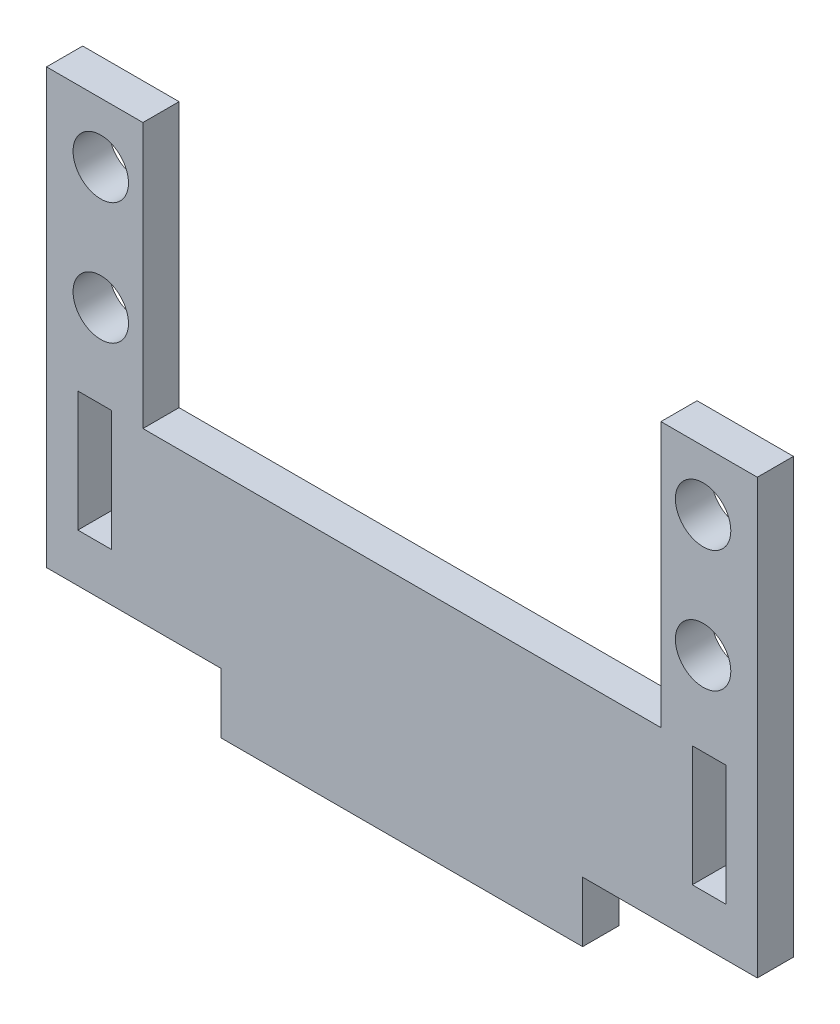
ISO-10303-21;
HEADER;
FILE_DESCRIPTION(('STEP AP214'),'2;1');
FILE_NAME('part.step','',(''),(''),'','','');
FILE_SCHEMA(('AUTOMOTIVE_DESIGN { 1 0 10303 214 1 1 1 1 }'));
ENDSEC;
DATA;
#1=APPLICATION_CONTEXT('core data for automotive mechanical design processes');
#2=APPLICATION_PROTOCOL_DEFINITION('international standard','automotive_design',2000,#1);
#3=PRODUCT_CONTEXT('',#1,'mechanical');
#4=PRODUCT('Part','Part','',(#3));
#5=PRODUCT_RELATED_PRODUCT_CATEGORY('part','',(#4));
#6=PRODUCT_DEFINITION_FORMATION('','',#4);
#7=PRODUCT_DEFINITION_CONTEXT('part definition',#1,'design');
#8=PRODUCT_DEFINITION('design','',#6,#7);
#9=PRODUCT_DEFINITION_SHAPE('','',#8);
#10=(LENGTH_UNIT() NAMED_UNIT(*) SI_UNIT(.MILLI.,.METRE.));
#11=(NAMED_UNIT(*) PLANE_ANGLE_UNIT() SI_UNIT($,.RADIAN.));
#12=(NAMED_UNIT(*) SI_UNIT($,.STERADIAN.) SOLID_ANGLE_UNIT());
#13=UNCERTAINTY_MEASURE_WITH_UNIT(LENGTH_MEASURE(1.E-05),#10,'distance_accuracy_value','');
#14=(GEOMETRIC_REPRESENTATION_CONTEXT(3) GLOBAL_UNCERTAINTY_ASSIGNED_CONTEXT((#13)) GLOBAL_UNIT_ASSIGNED_CONTEXT((#10,
#11,#12)) REPRESENTATION_CONTEXT('',''));
#15=CARTESIAN_POINT('',(0.,0.,0.));
#16=DIRECTION('',(0.,0.,1.));
#17=DIRECTION('',(1.,0.,0.));
#18=AXIS2_PLACEMENT_3D('',#15,#16,#17);
#19=CARTESIAN_POINT('',(0.,-36.,3.));
#20=DIRECTION('',(0.,1.,0.));
#21=DIRECTION('',(0.,0.,1.));
#22=AXIS2_PLACEMENT_3D('',#19,#20,#21);
#23=PLANE('',#22);
#24=DIRECTION('',(0.,0.,-1.));
#25=VECTOR('',#24,1.);
#26=CARTESIAN_POINT('',(14.5,-36.,3.));
#27=LINE('',#26,#25);
#28=CARTESIAN_POINT('',(14.5,-36.,3.));
#29=VERTEX_POINT('',#28);
#30=CARTESIAN_POINT('',(14.5,-36.,0.));
#31=VERTEX_POINT('',#30);
#32=EDGE_CURVE('E51',#29,#31,#27,.T.);
#33=ORIENTED_EDGE('',*,*,#32,.F.);
#34=DIRECTION('',(1.,0.,0.));
#35=VECTOR('',#34,1.);
#36=CARTESIAN_POINT('',(0.,-36.,3.));
#37=LINE('',#36,#35);
#38=CARTESIAN_POINT('',(0.,-36.,3.));
#39=VERTEX_POINT('',#38);
#40=EDGE_CURVE('E230',#39,#29,#37,.T.);
#41=ORIENTED_EDGE('',*,*,#40,.F.);
#42=DIRECTION('',(0.,0.,-1.));
#43=VECTOR('',#42,1.);
#44=CARTESIAN_POINT('',(0.,-36.,3.));
#45=LINE('',#44,#43);
#46=CARTESIAN_POINT('',(0.,-36.,0.));
#47=VERTEX_POINT('',#46);
#48=EDGE_CURVE('E315',#39,#47,#45,.T.);
#49=ORIENTED_EDGE('',*,*,#48,.T.);
#50=DIRECTION('',(1.,0.,0.));
#51=VECTOR('',#50,1.);
#52=CARTESIAN_POINT('',(0.,-36.,0.));
#53=LINE('',#52,#51);
#54=EDGE_CURVE('E283',#47,#31,#53,.T.);
#55=ORIENTED_EDGE('',*,*,#54,.T.);
#56=EDGE_LOOP('',(#33,#41,#49,#55));
#57=FACE_BOUND('',#56,.T.);
#58=ADVANCED_FACE('F34',(#57),#23,.F.);
#59=DIRECTION('',(0.,0.,1.));
#60=VECTOR('',#59,1.);
#61=CARTESIAN_POINT('',(44.5,-36.,3.));
#62=LINE('',#61,#60);
#63=CARTESIAN_POINT('',(44.5,-36.,0.));
#64=VERTEX_POINT('',#63);
#65=CARTESIAN_POINT('',(44.5,-36.,3.));
#66=VERTEX_POINT('',#65);
#67=EDGE_CURVE('E59',#64,#66,#62,.T.);
#68=ORIENTED_EDGE('',*,*,#67,.F.);
#69=CARTESIAN_POINT('',(59.,-36.,0.));
#70=VERTEX_POINT('',#69);
#71=EDGE_CURVE('E241',#64,#70,#53,.T.);
#72=ORIENTED_EDGE('',*,*,#71,.T.);
#73=DIRECTION('',(0.,0.,-1.));
#74=VECTOR('',#73,1.);
#75=CARTESIAN_POINT('',(59.,-36.,3.));
#76=LINE('',#75,#74);
#77=CARTESIAN_POINT('',(59.,-36.,3.));
#78=VERTEX_POINT('',#77);
#79=EDGE_CURVE('E317',#78,#70,#76,.T.);
#80=ORIENTED_EDGE('',*,*,#79,.F.);
#81=EDGE_CURVE('E217',#66,#78,#37,.T.);
#82=ORIENTED_EDGE('',*,*,#81,.F.);
#83=EDGE_LOOP('',(#68,#72,#80,#82));
#84=FACE_BOUND('',#83,.T.);
#85=ADVANCED_FACE('F374',(#84),#23,.F.);
#86=CARTESIAN_POINT('',(0.,0.,3.));
#87=DIRECTION('',(0.,1.,0.));
#88=DIRECTION('',(-1.,0.,0.));
#89=AXIS2_PLACEMENT_3D('',#86,#87,#88);
#90=PLANE('',#89);
#91=DIRECTION('',(1.,0.,0.));
#92=VECTOR('',#91,1.);
#93=CARTESIAN_POINT('',(0.,0.,0.));
#94=LINE('',#93,#92);
#95=CARTESIAN_POINT('',(51.,0.,0.));
#96=VERTEX_POINT('',#95);
#97=CARTESIAN_POINT('',(59.,0.,0.));
#98=VERTEX_POINT('',#97);
#99=EDGE_CURVE('E262',#96,#98,#94,.T.);
#100=ORIENTED_EDGE('',*,*,#99,.F.);
#101=DIRECTION('',(0.,0.,-1.));
#102=VECTOR('',#101,1.);
#103=CARTESIAN_POINT('',(51.,0.,3.));
#104=LINE('',#103,#102);
#105=CARTESIAN_POINT('',(51.,0.,3.));
#106=VERTEX_POINT('',#105);
#107=EDGE_CURVE('E305',#106,#96,#104,.T.);
#108=ORIENTED_EDGE('',*,*,#107,.F.);
#109=DIRECTION('',(1.,0.,0.));
#110=VECTOR('',#109,1.);
#111=CARTESIAN_POINT('',(0.,0.,3.));
#112=LINE('',#111,#110);
#113=CARTESIAN_POINT('',(59.,0.,3.));
#114=VERTEX_POINT('',#113);
#115=EDGE_CURVE('E323',#106,#114,#112,.T.);
#116=ORIENTED_EDGE('',*,*,#115,.T.);
#117=DIRECTION('',(0.,0.,-1.));
#118=VECTOR('',#117,1.);
#119=CARTESIAN_POINT('',(59.,0.,3.));
#120=LINE('',#119,#118);
#121=EDGE_CURVE('E238',#114,#98,#120,.T.);
#122=ORIENTED_EDGE('',*,*,#121,.T.);
#123=EDGE_LOOP('',(#100,#108,#116,#122));
#124=FACE_BOUND('',#123,.T.);
#125=ADVANCED_FACE('F322',(#124),#90,.T.);
#126=CARTESIAN_POINT('',(51.,0.,3.));
#127=DIRECTION('',(-1.,0.,0.));
#128=DIRECTION('',(0.,0.,1.));
#129=AXIS2_PLACEMENT_3D('',#126,#127,#128);
#130=PLANE('',#129);
#131=DIRECTION('',(0.,1.,0.));
#132=VECTOR('',#131,1.);
#133=CARTESIAN_POINT('',(51.,0.,0.));
#134=LINE('',#133,#132);
#135=CARTESIAN_POINT('',(51.,-22.,0.));
#136=VERTEX_POINT('',#135);
#137=EDGE_CURVE('E264',#136,#96,#134,.T.);
#138=ORIENTED_EDGE('',*,*,#137,.F.);
#139=DIRECTION('',(0.,0.,-1.));
#140=VECTOR('',#139,1.);
#141=CARTESIAN_POINT('',(51.,-22.,3.));
#142=LINE('',#141,#140);
#143=CARTESIAN_POINT('',(51.,-22.,3.));
#144=VERTEX_POINT('',#143);
#145=EDGE_CURVE('E307',#144,#136,#142,.T.);
#146=ORIENTED_EDGE('',*,*,#145,.F.);
#147=DIRECTION('',(0.,1.,0.));
#148=VECTOR('',#147,1.);
#149=CARTESIAN_POINT('',(51.,0.,3.));
#150=LINE('',#149,#148);
#151=EDGE_CURVE('E350',#144,#106,#150,.T.);
#152=ORIENTED_EDGE('',*,*,#151,.T.);
#153=ORIENTED_EDGE('',*,*,#107,.T.);
#154=EDGE_LOOP('',(#138,#146,#152,#153));
#155=FACE_BOUND('',#154,.T.);
#156=ADVANCED_FACE('F392',(#155),#130,.T.);
#157=CARTESIAN_POINT('',(0.,-22.,3.));
#158=DIRECTION('',(0.,1.,0.));
#159=DIRECTION('',(0.,0.,1.));
#160=AXIS2_PLACEMENT_3D('',#157,#158,#159);
#161=PLANE('',#160);
#162=DIRECTION('',(1.,0.,0.));
#163=VECTOR('',#162,1.);
#164=CARTESIAN_POINT('',(0.,-22.,0.));
#165=LINE('',#164,#163);
#166=CARTESIAN_POINT('',(8.,-22.,0.));
#167=VERTEX_POINT('',#166);
#168=EDGE_CURVE('E267',#167,#136,#165,.T.);
#169=ORIENTED_EDGE('',*,*,#168,.F.);
#170=DIRECTION('',(0.,0.,-1.));
#171=VECTOR('',#170,1.);
#172=CARTESIAN_POINT('',(8.,-22.,3.));
#173=LINE('',#172,#171);
#174=CARTESIAN_POINT('',(8.,-22.,3.));
#175=VERTEX_POINT('',#174);
#176=EDGE_CURVE('E309',#175,#167,#173,.T.);
#177=ORIENTED_EDGE('',*,*,#176,.F.);
#178=DIRECTION('',(1.,0.,0.));
#179=VECTOR('',#178,1.);
#180=CARTESIAN_POINT('',(0.,-22.,3.));
#181=LINE('',#180,#179);
#182=EDGE_CURVE('E353',#175,#144,#181,.T.);
#183=ORIENTED_EDGE('',*,*,#182,.T.);
#184=ORIENTED_EDGE('',*,*,#145,.T.);
#185=EDGE_LOOP('',(#169,#177,#183,#184));
#186=FACE_BOUND('',#185,.T.);
#187=ADVANCED_FACE('F389',(#186),#161,.T.);
#188=CARTESIAN_POINT('',(8.,0.,3.));
#189=DIRECTION('',(1.,0.,0.));
#190=DIRECTION('',(0.,0.,-1.));
#191=AXIS2_PLACEMENT_3D('',#188,#189,#190);
#192=PLANE('',#191);
#193=DIRECTION('',(0.,-1.,0.));
#194=VECTOR('',#193,1.);
#195=CARTESIAN_POINT('',(8.,0.,0.));
#196=LINE('',#195,#194);
#197=CARTESIAN_POINT('',(8.,0.,0.));
#198=VERTEX_POINT('',#197);
#199=EDGE_CURVE('E270',#198,#167,#196,.T.);
#200=ORIENTED_EDGE('',*,*,#199,.F.);
#201=DIRECTION('',(0.,0.,-1.));
#202=VECTOR('',#201,1.);
#203=CARTESIAN_POINT('',(8.,0.,3.));
#204=LINE('',#203,#202);
#205=CARTESIAN_POINT('',(8.,0.,3.));
#206=VERTEX_POINT('',#205);
#207=EDGE_CURVE('E311',#206,#198,#204,.T.);
#208=ORIENTED_EDGE('',*,*,#207,.F.);
#209=DIRECTION('',(0.,-1.,0.));
#210=VECTOR('',#209,1.);
#211=CARTESIAN_POINT('',(8.,0.,3.));
#212=LINE('',#211,#210);
#213=EDGE_CURVE('E356',#206,#175,#212,.T.);
#214=ORIENTED_EDGE('',*,*,#213,.T.);
#215=ORIENTED_EDGE('',*,*,#176,.T.);
#216=EDGE_LOOP('',(#200,#208,#214,#215));
#217=FACE_BOUND('',#216,.T.);
#218=ADVANCED_FACE('F368',(#217),#192,.T.);
#219=CARTESIAN_POINT('',(0.,0.,3.));
#220=DIRECTION('',(0.,1.,0.));
#221=DIRECTION('',(0.,0.,1.));
#222=AXIS2_PLACEMENT_3D('',#219,#220,#221);
#223=PLANE('',#222);
#224=DIRECTION('',(1.,0.,0.));
#225=VECTOR('',#224,1.);
#226=CARTESIAN_POINT('',(0.,0.,0.));
#227=LINE('',#226,#225);
#228=CARTESIAN_POINT('',(0.,0.,0.));
#229=VERTEX_POINT('',#228);
#230=EDGE_CURVE('E273',#229,#198,#227,.T.);
#231=ORIENTED_EDGE('',*,*,#230,.F.);
#232=DIRECTION('',(0.,0.,-1.));
#233=VECTOR('',#232,1.);
#234=CARTESIAN_POINT('',(0.,0.,3.));
#235=LINE('',#234,#233);
#236=CARTESIAN_POINT('',(0.,0.,3.));
#237=VERTEX_POINT('',#236);
#238=EDGE_CURVE('E313',#237,#229,#235,.T.);
#239=ORIENTED_EDGE('',*,*,#238,.F.);
#240=DIRECTION('',(1.,0.,0.));
#241=VECTOR('',#240,1.);
#242=CARTESIAN_POINT('',(0.,0.,3.));
#243=LINE('',#242,#241);
#244=EDGE_CURVE('E358',#237,#206,#243,.T.);
#245=ORIENTED_EDGE('',*,*,#244,.T.);
#246=ORIENTED_EDGE('',*,*,#207,.T.);
#247=EDGE_LOOP('',(#231,#239,#245,#246));
#248=FACE_BOUND('',#247,.T.);
#249=ADVANCED_FACE('F362',(#248),#223,.T.);
#250=CARTESIAN_POINT('',(0.,0.,3.));
#251=DIRECTION('',(1.,0.,0.));
#252=DIRECTION('',(0.,1.,0.));
#253=AXIS2_PLACEMENT_3D('',#250,#251,#252);
#254=PLANE('',#253);
#255=DIRECTION('',(0.,-1.,0.));
#256=VECTOR('',#255,1.);
#257=CARTESIAN_POINT('',(0.,0.,0.));
#258=LINE('',#257,#256);
#259=EDGE_CURVE('E276',#229,#47,#258,.T.);
#260=ORIENTED_EDGE('',*,*,#259,.T.);
#261=ORIENTED_EDGE('',*,*,#48,.F.);
#262=DIRECTION('',(0.,-1.,0.));
#263=VECTOR('',#262,1.);
#264=CARTESIAN_POINT('',(0.,0.,3.));
#265=LINE('',#264,#263);
#266=EDGE_CURVE('E233',#237,#39,#265,.T.);
#267=ORIENTED_EDGE('',*,*,#266,.F.);
#268=ORIENTED_EDGE('',*,*,#238,.T.);
#269=EDGE_LOOP('',(#260,#261,#267,#268));
#270=FACE_BOUND('',#269,.T.);
#271=ADVANCED_FACE('F372',(#270),#254,.F.);
#272=CARTESIAN_POINT('',(4.5,-15.05,3.));
#273=DIRECTION('',(0.,0.,-1.));
#274=DIRECTION('',(-1.,0.,0.));
#275=AXIS2_PLACEMENT_3D('',#272,#273,#274);
#276=CYLINDRICAL_SURFACE('',#275,2.3);
#277=CARTESIAN_POINT('',(4.5,-15.05,3.));
#278=DIRECTION('',(0.,0.,1.));
#279=DIRECTION('',(1.,0.,0.));
#280=AXIS2_PLACEMENT_3D('',#277,#278,#279);
#281=CIRCLE('',#280,2.3);
#282=CARTESIAN_POINT('',(6.8,-15.05,3.));
#283=VERTEX_POINT('',#282);
#284=EDGE_CURVE('E346',#283,#283,#281,.T.);
#285=ORIENTED_EDGE('',*,*,#284,.T.);
#286=EDGE_LOOP('',(#285));
#287=FACE_BOUND('',#286,.T.);
#288=CARTESIAN_POINT('',(4.5,-15.05,0.));
#289=DIRECTION('',(0.,0.,1.));
#290=DIRECTION('',(1.,0.,0.));
#291=AXIS2_PLACEMENT_3D('',#288,#289,#290);
#292=CIRCLE('',#291,2.3);
#293=CARTESIAN_POINT('',(6.8,-15.05,0.));
#294=VERTEX_POINT('',#293);
#295=EDGE_CURVE('E259',#294,#294,#292,.T.);
#296=ORIENTED_EDGE('',*,*,#295,.F.);
#297=EDGE_LOOP('',(#296));
#298=FACE_BOUND('',#297,.T.);
#299=ADVANCED_FACE('F384',(#287,#298),#276,.F.);
#300=CARTESIAN_POINT('',(4.5,-4.95,3.));
#301=DIRECTION('',(0.,0.,-1.));
#302=DIRECTION('',(-1.,0.,0.));
#303=AXIS2_PLACEMENT_3D('',#300,#301,#302);
#304=CYLINDRICAL_SURFACE('',#303,2.3);
#305=CARTESIAN_POINT('',(4.5,-4.95,3.));
#306=DIRECTION('',(0.,0.,1.));
#307=DIRECTION('',(1.,0.,0.));
#308=AXIS2_PLACEMENT_3D('',#305,#306,#307);
#309=CIRCLE('',#308,2.3);
#310=CARTESIAN_POINT('',(6.8,-4.95,3.));
#311=VERTEX_POINT('',#310);
#312=EDGE_CURVE('E338',#311,#311,#309,.T.);
#313=ORIENTED_EDGE('',*,*,#312,.T.);
#314=EDGE_LOOP('',(#313));
#315=FACE_BOUND('',#314,.T.);
#316=CARTESIAN_POINT('',(4.5,-4.95,0.));
#317=DIRECTION('',(0.,0.,1.));
#318=DIRECTION('',(1.,0.,0.));
#319=AXIS2_PLACEMENT_3D('',#316,#317,#318);
#320=CIRCLE('',#319,2.3);
#321=CARTESIAN_POINT('',(6.8,-4.95,0.));
#322=VERTEX_POINT('',#321);
#323=EDGE_CURVE('E256',#322,#322,#320,.T.);
#324=ORIENTED_EDGE('',*,*,#323,.F.);
#325=EDGE_LOOP('',(#324));
#326=FACE_BOUND('',#325,.T.);
#327=ADVANCED_FACE('F401',(#315,#326),#304,.F.);
#328=CARTESIAN_POINT('',(54.5,-4.94999999999999,3.));
#329=DIRECTION('',(0.,0.,-1.));
#330=DIRECTION('',(-1.,0.,0.));
#331=AXIS2_PLACEMENT_3D('',#328,#329,#330);
#332=CYLINDRICAL_SURFACE('',#331,2.3);
#333=CARTESIAN_POINT('',(54.5,-4.94999999999999,3.));
#334=DIRECTION('',(0.,0.,1.));
#335=DIRECTION('',(1.,0.,0.));
#336=AXIS2_PLACEMENT_3D('',#333,#334,#335);
#337=CIRCLE('',#336,2.3);
#338=CARTESIAN_POINT('',(56.8,-4.94999999999999,3.));
#339=VERTEX_POINT('',#338);
#340=EDGE_CURVE('E333',#339,#339,#337,.T.);
#341=ORIENTED_EDGE('',*,*,#340,.T.);
#342=EDGE_LOOP('',(#341));
#343=FACE_BOUND('',#342,.T.);
#344=CARTESIAN_POINT('',(54.5,-4.94999999999999,0.));
#345=DIRECTION('',(0.,0.,1.));
#346=DIRECTION('',(1.,0.,0.));
#347=AXIS2_PLACEMENT_3D('',#344,#345,#346);
#348=CIRCLE('',#347,2.3);
#349=CARTESIAN_POINT('',(56.8,-4.94999999999999,0.));
#350=VERTEX_POINT('',#349);
#351=EDGE_CURVE('E252',#350,#350,#348,.T.);
#352=ORIENTED_EDGE('',*,*,#351,.F.);
#353=EDGE_LOOP('',(#352));
#354=FACE_BOUND('',#353,.T.);
#355=ADVANCED_FACE('F404',(#343,#354),#332,.F.);
#356=CARTESIAN_POINT('',(54.5,-15.05,3.));
#357=DIRECTION('',(0.,0.,-1.));
#358=DIRECTION('',(-1.,0.,0.));
#359=AXIS2_PLACEMENT_3D('',#356,#357,#358);
#360=CYLINDRICAL_SURFACE('',#359,2.3);
#361=CARTESIAN_POINT('',(54.5,-15.05,3.));
#362=DIRECTION('',(0.,0.,1.));
#363=DIRECTION('',(1.,0.,0.));
#364=AXIS2_PLACEMENT_3D('',#361,#362,#363);
#365=CIRCLE('',#364,2.3);
#366=CARTESIAN_POINT('',(56.8,-15.05,3.));
#367=VERTEX_POINT('',#366);
#368=EDGE_CURVE('E331',#367,#367,#365,.T.);
#369=ORIENTED_EDGE('',*,*,#368,.T.);
#370=EDGE_LOOP('',(#369));
#371=FACE_BOUND('',#370,.T.);
#372=CARTESIAN_POINT('',(54.5,-15.05,0.));
#373=DIRECTION('',(0.,0.,1.));
#374=DIRECTION('',(1.,0.,0.));
#375=AXIS2_PLACEMENT_3D('',#372,#373,#374);
#376=CIRCLE('',#375,2.3);
#377=CARTESIAN_POINT('',(56.8,-15.05,0.));
#378=VERTEX_POINT('',#377);
#379=EDGE_CURVE('E249',#378,#378,#376,.T.);
#380=ORIENTED_EDGE('',*,*,#379,.F.);
#381=EDGE_LOOP('',(#380));
#382=FACE_BOUND('',#381,.T.);
#383=ADVANCED_FACE('F36',(#371,#382),#360,.F.);
#384=CARTESIAN_POINT('',(59.,0.,3.));
#385=DIRECTION('',(1.,0.,0.));
#386=DIRECTION('',(0.,1.,0.));
#387=AXIS2_PLACEMENT_3D('',#384,#385,#386);
#388=PLANE('',#387);
#389=DIRECTION('',(0.,-1.,0.));
#390=VECTOR('',#389,1.);
#391=CARTESIAN_POINT('',(59.,0.,0.));
#392=LINE('',#391,#390);
#393=EDGE_CURVE('E280',#98,#70,#392,.T.);
#394=ORIENTED_EDGE('',*,*,#393,.F.);
#395=ORIENTED_EDGE('',*,*,#121,.F.);
#396=DIRECTION('',(0.,-1.,0.));
#397=VECTOR('',#396,1.);
#398=CARTESIAN_POINT('',(59.,0.,3.));
#399=LINE('',#398,#397);
#400=EDGE_CURVE('E236',#114,#78,#399,.T.);
#401=ORIENTED_EDGE('',*,*,#400,.T.);
#402=ORIENTED_EDGE('',*,*,#79,.T.);
#403=EDGE_LOOP('',(#394,#395,#401,#402));
#404=FACE_BOUND('',#403,.T.);
#405=ADVANCED_FACE('F329',(#404),#388,.T.);
#406=CARTESIAN_POINT('',(0.,0.,3.));
#407=DIRECTION('',(0.,0.,1.));
#408=DIRECTION('',(1.,0.,0.));
#409=AXIS2_PLACEMENT_3D('',#406,#407,#408);
#410=PLANE('',#409);
#411=DIRECTION('',(0.,-1.,0.));
#412=VECTOR('',#411,1.);
#413=CARTESIAN_POINT('',(53.6,-22.,3.));
#414=LINE('',#413,#412);
#415=CARTESIAN_POINT('',(53.6,-22.,3.));
#416=VERTEX_POINT('',#415);
#417=CARTESIAN_POINT('',(53.6,-32.,3.));
#418=VERTEX_POINT('',#417);
#419=EDGE_CURVE('E195',#416,#418,#414,.T.);
#420=ORIENTED_EDGE('',*,*,#419,.F.);
#421=DIRECTION('',(-1.,0.,0.));
#422=VECTOR('',#421,1.);
#423=CARTESIAN_POINT('',(53.6,-22.,3.));
#424=LINE('',#423,#422);
#425=CARTESIAN_POINT('',(56.4,-22.,3.));
#426=VERTEX_POINT('',#425);
#427=EDGE_CURVE('E630',#426,#416,#424,.T.);
#428=ORIENTED_EDGE('',*,*,#427,.F.);
#429=DIRECTION('',(0.,1.,0.));
#430=VECTOR('',#429,1.);
#431=CARTESIAN_POINT('',(56.4,-22.,3.));
#432=LINE('',#431,#430);
#433=CARTESIAN_POINT('',(56.4,-32.,3.));
#434=VERTEX_POINT('',#433);
#435=EDGE_CURVE('E637',#434,#426,#432,.T.);
#436=ORIENTED_EDGE('',*,*,#435,.F.);
#437=DIRECTION('',(1.,0.,0.));
#438=VECTOR('',#437,1.);
#439=CARTESIAN_POINT('',(53.6,-32.,3.));
#440=LINE('',#439,#438);
#441=EDGE_CURVE('E197',#418,#434,#440,.T.);
#442=ORIENTED_EDGE('',*,*,#441,.F.);
#443=EDGE_LOOP('',(#420,#428,#436,#442));
#444=FACE_BOUND('',#443,.T.);
#445=DIRECTION('',(0.,-1.,0.));
#446=VECTOR('',#445,1.);
#447=CARTESIAN_POINT('',(2.6,-22.,3.));
#448=LINE('',#447,#446);
#449=CARTESIAN_POINT('',(2.6,-22.,3.));
#450=VERTEX_POINT('',#449);
#451=CARTESIAN_POINT('',(2.6,-32.,3.));
#452=VERTEX_POINT('',#451);
#453=EDGE_CURVE('E647',#450,#452,#448,.T.);
#454=ORIENTED_EDGE('',*,*,#453,.F.);
#455=DIRECTION('',(-1.,0.,0.));
#456=VECTOR('',#455,1.);
#457=CARTESIAN_POINT('',(2.6,-22.,3.));
#458=LINE('',#457,#456);
#459=CARTESIAN_POINT('',(5.4,-22.,3.));
#460=VERTEX_POINT('',#459);
#461=EDGE_CURVE('E657',#460,#450,#458,.T.);
#462=ORIENTED_EDGE('',*,*,#461,.F.);
#463=DIRECTION('',(0.,1.,0.));
#464=VECTOR('',#463,1.);
#465=CARTESIAN_POINT('',(5.4,-22.,3.));
#466=LINE('',#465,#464);
#467=CARTESIAN_POINT('',(5.4,-32.,3.));
#468=VERTEX_POINT('',#467);
#469=EDGE_CURVE('E654',#468,#460,#466,.T.);
#470=ORIENTED_EDGE('',*,*,#469,.F.);
#471=DIRECTION('',(1.,0.,0.));
#472=VECTOR('',#471,1.);
#473=CARTESIAN_POINT('',(2.6,-32.,3.));
#474=LINE('',#473,#472);
#475=EDGE_CURVE('E651',#452,#468,#474,.T.);
#476=ORIENTED_EDGE('',*,*,#475,.F.);
#477=EDGE_LOOP('',(#454,#462,#470,#476));
#478=FACE_BOUND('',#477,.T.);
#479=ORIENTED_EDGE('',*,*,#368,.F.);
#480=EDGE_LOOP('',(#479));
#481=FACE_BOUND('',#480,.T.);
#482=ORIENTED_EDGE('',*,*,#340,.F.);
#483=EDGE_LOOP('',(#482));
#484=FACE_BOUND('',#483,.T.);
#485=ORIENTED_EDGE('',*,*,#312,.F.);
#486=EDGE_LOOP('',(#485));
#487=FACE_BOUND('',#486,.T.);
#488=ORIENTED_EDGE('',*,*,#284,.F.);
#489=EDGE_LOOP('',(#488));
#490=FACE_BOUND('',#489,.T.);
#491=ORIENTED_EDGE('',*,*,#115,.F.);
#492=ORIENTED_EDGE('',*,*,#151,.F.);
#493=ORIENTED_EDGE('',*,*,#182,.F.);
#494=ORIENTED_EDGE('',*,*,#213,.F.);
#495=ORIENTED_EDGE('',*,*,#244,.F.);
#496=ORIENTED_EDGE('',*,*,#266,.T.);
#497=ORIENTED_EDGE('',*,*,#40,.T.);
#498=DIRECTION('',(0.,1.,0.));
#499=VECTOR('',#498,1.);
#500=CARTESIAN_POINT('',(14.5,-41.,3.));
#501=LINE('',#500,#499);
#502=CARTESIAN_POINT('',(14.5,-41.,3.));
#503=VERTEX_POINT('',#502);
#504=EDGE_CURVE('E207',#503,#29,#501,.T.);
#505=ORIENTED_EDGE('',*,*,#504,.F.);
#506=DIRECTION('',(-1.,0.,0.));
#507=VECTOR('',#506,1.);
#508=CARTESIAN_POINT('',(14.5,-41.,3.));
#509=LINE('',#508,#507);
#510=CARTESIAN_POINT('',(44.5,-41.,3.));
#511=VERTEX_POINT('',#510);
#512=EDGE_CURVE('E189',#511,#503,#509,.T.);
#513=ORIENTED_EDGE('',*,*,#512,.F.);
#514=DIRECTION('',(0.,1.,0.));
#515=VECTOR('',#514,1.);
#516=CARTESIAN_POINT('',(44.5,-41.,3.));
#517=LINE('',#516,#515);
#518=EDGE_CURVE('E199',#511,#66,#517,.T.);
#519=ORIENTED_EDGE('',*,*,#518,.T.);
#520=ORIENTED_EDGE('',*,*,#81,.T.);
#521=ORIENTED_EDGE('',*,*,#400,.F.);
#522=EDGE_LOOP('',(#491,#492,#493,#494,#495,#496,#497,#505,#513,#519,#520,#521));
#523=FACE_BOUND('',#522,.T.);
#524=ADVANCED_FACE('F228',(#444,#478,#481,#484,#487,#490,#523),#410,.T.);
#525=CARTESIAN_POINT('',(0.,0.,0.));
#526=DIRECTION('',(0.,0.,1.));
#527=DIRECTION('',(1.,0.,0.));
#528=AXIS2_PLACEMENT_3D('',#525,#526,#527);
#529=PLANE('',#528);
#530=DIRECTION('',(-1.,0.,0.));
#531=VECTOR('',#530,1.);
#532=CARTESIAN_POINT('',(0.,-22.,0.));
#533=LINE('',#532,#531);
#534=CARTESIAN_POINT('',(56.4,-22.,0.));
#535=VERTEX_POINT('',#534);
#536=CARTESIAN_POINT('',(53.6,-22.,0.));
#537=VERTEX_POINT('',#536);
#538=EDGE_CURVE('E43',#535,#537,#533,.T.);
#539=ORIENTED_EDGE('',*,*,#538,.T.);
#540=DIRECTION('',(0.,-1.,0.));
#541=VECTOR('',#540,1.);
#542=CARTESIAN_POINT('',(53.6,0.,0.));
#543=LINE('',#542,#541);
#544=CARTESIAN_POINT('',(53.6,-32.,0.));
#545=VERTEX_POINT('',#544);
#546=EDGE_CURVE('E11',#537,#545,#543,.T.);
#547=ORIENTED_EDGE('',*,*,#546,.T.);
#548=DIRECTION('',(1.,0.,0.));
#549=VECTOR('',#548,1.);
#550=CARTESIAN_POINT('',(0.,-32.,0.));
#551=LINE('',#550,#549);
#552=CARTESIAN_POINT('',(56.4,-32.,0.));
#553=VERTEX_POINT('',#552);
#554=EDGE_CURVE('E290',#545,#553,#551,.T.);
#555=ORIENTED_EDGE('',*,*,#554,.T.);
#556=DIRECTION('',(0.,1.,0.));
#557=VECTOR('',#556,1.);
#558=CARTESIAN_POINT('',(56.4,0.,0.));
#559=LINE('',#558,#557);
#560=EDGE_CURVE('E287',#553,#535,#559,.T.);
#561=ORIENTED_EDGE('',*,*,#560,.T.);
#562=EDGE_LOOP('',(#539,#547,#555,#561));
#563=FACE_BOUND('',#562,.T.);
#564=DIRECTION('',(-1.,0.,0.));
#565=VECTOR('',#564,1.);
#566=CARTESIAN_POINT('',(0.,-22.,0.));
#567=LINE('',#566,#565);
#568=CARTESIAN_POINT('',(5.4,-22.,0.));
#569=VERTEX_POINT('',#568);
#570=CARTESIAN_POINT('',(2.6,-22.,0.));
#571=VERTEX_POINT('',#570);
#572=EDGE_CURVE('E296',#569,#571,#567,.T.);
#573=ORIENTED_EDGE('',*,*,#572,.T.);
#574=DIRECTION('',(0.,-1.,0.));
#575=VECTOR('',#574,1.);
#576=CARTESIAN_POINT('',(2.6,0.,0.));
#577=LINE('',#576,#575);
#578=CARTESIAN_POINT('',(2.6,-32.,0.));
#579=VERTEX_POINT('',#578);
#580=EDGE_CURVE('E293',#571,#579,#577,.T.);
#581=ORIENTED_EDGE('',*,*,#580,.T.);
#582=DIRECTION('',(1.,0.,0.));
#583=VECTOR('',#582,1.);
#584=CARTESIAN_POINT('',(0.,-32.,0.));
#585=LINE('',#584,#583);
#586=CARTESIAN_POINT('',(5.4,-32.,0.));
#587=VERTEX_POINT('',#586);
#588=EDGE_CURVE('E302',#579,#587,#585,.T.);
#589=ORIENTED_EDGE('',*,*,#588,.T.);
#590=DIRECTION('',(0.,1.,0.));
#591=VECTOR('',#590,1.);
#592=CARTESIAN_POINT('',(5.4,0.,0.));
#593=LINE('',#592,#591);
#594=EDGE_CURVE('E299',#587,#569,#593,.T.);
#595=ORIENTED_EDGE('',*,*,#594,.T.);
#596=EDGE_LOOP('',(#573,#581,#589,#595));
#597=FACE_BOUND('',#596,.T.);
#598=ORIENTED_EDGE('',*,*,#379,.T.);
#599=EDGE_LOOP('',(#598));
#600=FACE_BOUND('',#599,.T.);
#601=ORIENTED_EDGE('',*,*,#351,.T.);
#602=EDGE_LOOP('',(#601));
#603=FACE_BOUND('',#602,.T.);
#604=ORIENTED_EDGE('',*,*,#323,.T.);
#605=EDGE_LOOP('',(#604));
#606=FACE_BOUND('',#605,.T.);
#607=ORIENTED_EDGE('',*,*,#295,.T.);
#608=EDGE_LOOP('',(#607));
#609=FACE_BOUND('',#608,.T.);
#610=ORIENTED_EDGE('',*,*,#99,.T.);
#611=ORIENTED_EDGE('',*,*,#393,.T.);
#612=ORIENTED_EDGE('',*,*,#71,.F.);
#613=DIRECTION('',(0.,1.,0.));
#614=VECTOR('',#613,1.);
#615=CARTESIAN_POINT('',(44.5,-41.,0.));
#616=LINE('',#615,#614);
#617=CARTESIAN_POINT('',(44.5,-41.,0.));
#618=VERTEX_POINT('',#617);
#619=EDGE_CURVE('E180',#618,#64,#616,.T.);
#620=ORIENTED_EDGE('',*,*,#619,.F.);
#621=DIRECTION('',(1.,0.,0.));
#622=VECTOR('',#621,1.);
#623=CARTESIAN_POINT('',(14.5,-41.,0.));
#624=LINE('',#623,#622);
#625=CARTESIAN_POINT('',(14.5,-41.,0.));
#626=VERTEX_POINT('',#625);
#627=EDGE_CURVE('E173',#626,#618,#624,.T.);
#628=ORIENTED_EDGE('',*,*,#627,.F.);
#629=DIRECTION('',(0.,1.,0.));
#630=VECTOR('',#629,1.);
#631=CARTESIAN_POINT('',(14.5,-41.,0.));
#632=LINE('',#631,#630);
#633=EDGE_CURVE('E178',#626,#31,#632,.T.);
#634=ORIENTED_EDGE('',*,*,#633,.T.);
#635=ORIENTED_EDGE('',*,*,#54,.F.);
#636=ORIENTED_EDGE('',*,*,#259,.F.);
#637=ORIENTED_EDGE('',*,*,#230,.T.);
#638=ORIENTED_EDGE('',*,*,#199,.T.);
#639=ORIENTED_EDGE('',*,*,#168,.T.);
#640=ORIENTED_EDGE('',*,*,#137,.T.);
#641=EDGE_LOOP('',(#610,#611,#612,#620,#628,#634,#635,#636,#637,#638,#639,#640));
#642=FACE_BOUND('',#641,.T.);
#643=ADVANCED_FACE('F176',(#563,#597,#600,#603,#606,#609,#642),#529,.F.);
#644=CARTESIAN_POINT('',(2.6,-22.,-7.));
#645=DIRECTION('',(-1.,0.,0.));
#646=DIRECTION('',(0.,-1.,0.));
#647=AXIS2_PLACEMENT_3D('',#644,#645,#646);
#648=PLANE('',#647);
#649=DIRECTION('',(0.,0.,1.));
#650=VECTOR('',#649,1.);
#651=CARTESIAN_POINT('',(2.6,-22.,-7.));
#652=LINE('',#651,#650);
#653=EDGE_CURVE('E253',#571,#450,#652,.T.);
#654=ORIENTED_EDGE('',*,*,#653,.T.);
#655=ORIENTED_EDGE('',*,*,#453,.T.);
#656=DIRECTION('',(0.,0.,1.));
#657=VECTOR('',#656,1.);
#658=CARTESIAN_POINT('',(2.6,-32.,-7.));
#659=LINE('',#658,#657);
#660=EDGE_CURVE('E341',#579,#452,#659,.T.);
#661=ORIENTED_EDGE('',*,*,#660,.F.);
#662=ORIENTED_EDGE('',*,*,#580,.F.);
#663=EDGE_LOOP('',(#654,#655,#661,#662));
#664=FACE_BOUND('',#663,.T.);
#665=ADVANCED_FACE('F417',(#664),#648,.F.);
#666=CARTESIAN_POINT('',(2.6,-22.,-7.));
#667=DIRECTION('',(0.,1.,0.));
#668=DIRECTION('',(-1.,0.,0.));
#669=AXIS2_PLACEMENT_3D('',#666,#667,#668);
#670=PLANE('',#669);
#671=DIRECTION('',(0.,0.,1.));
#672=VECTOR('',#671,1.);
#673=CARTESIAN_POINT('',(5.4,-22.,-7.));
#674=LINE('',#673,#672);
#675=EDGE_CURVE('E661',#569,#460,#674,.T.);
#676=ORIENTED_EDGE('',*,*,#675,.T.);
#677=ORIENTED_EDGE('',*,*,#461,.T.);
#678=ORIENTED_EDGE('',*,*,#653,.F.);
#679=ORIENTED_EDGE('',*,*,#572,.F.);
#680=EDGE_LOOP('',(#676,#677,#678,#679));
#681=FACE_BOUND('',#680,.T.);
#682=ADVANCED_FACE('F428',(#681),#670,.F.);
#683=CARTESIAN_POINT('',(5.4,-22.,-7.));
#684=DIRECTION('',(1.,0.,0.));
#685=DIRECTION('',(0.,1.,0.));
#686=AXIS2_PLACEMENT_3D('',#683,#684,#685);
#687=PLANE('',#686);
#688=DIRECTION('',(0.,0.,1.));
#689=VECTOR('',#688,1.);
#690=CARTESIAN_POINT('',(5.4,-32.,-7.));
#691=LINE('',#690,#689);
#692=EDGE_CURVE('E662',#587,#468,#691,.T.);
#693=ORIENTED_EDGE('',*,*,#692,.T.);
#694=ORIENTED_EDGE('',*,*,#469,.T.);
#695=ORIENTED_EDGE('',*,*,#675,.F.);
#696=ORIENTED_EDGE('',*,*,#594,.F.);
#697=EDGE_LOOP('',(#693,#694,#695,#696));
#698=FACE_BOUND('',#697,.T.);
#699=ADVANCED_FACE('F439',(#698),#687,.F.);
#700=CARTESIAN_POINT('',(2.6,-32.,-7.));
#701=DIRECTION('',(0.,-1.,0.));
#702=DIRECTION('',(0.,0.,-1.));
#703=AXIS2_PLACEMENT_3D('',#700,#701,#702);
#704=PLANE('',#703);
#705=ORIENTED_EDGE('',*,*,#660,.T.);
#706=ORIENTED_EDGE('',*,*,#475,.T.);
#707=ORIENTED_EDGE('',*,*,#692,.F.);
#708=ORIENTED_EDGE('',*,*,#588,.F.);
#709=EDGE_LOOP('',(#705,#706,#707,#708));
#710=FACE_BOUND('',#709,.T.);
#711=ADVANCED_FACE('F435',(#710),#704,.F.);
#712=CARTESIAN_POINT('',(53.6,-22.,-7.));
#713=DIRECTION('',(-1.,0.,0.));
#714=DIRECTION('',(0.,-1.,0.));
#715=AXIS2_PLACEMENT_3D('',#712,#713,#714);
#716=PLANE('',#715);
#717=DIRECTION('',(0.,0.,1.));
#718=VECTOR('',#717,1.);
#719=CARTESIAN_POINT('',(53.6,-22.,-7.));
#720=LINE('',#719,#718);
#721=EDGE_CURVE('E633',#537,#416,#720,.T.);
#722=ORIENTED_EDGE('',*,*,#721,.T.);
#723=ORIENTED_EDGE('',*,*,#419,.T.);
#724=DIRECTION('',(0.,0.,1.));
#725=VECTOR('',#724,1.);
#726=CARTESIAN_POINT('',(53.6,-32.,-7.));
#727=LINE('',#726,#725);
#728=EDGE_CURVE('E642',#545,#418,#727,.T.);
#729=ORIENTED_EDGE('',*,*,#728,.F.);
#730=ORIENTED_EDGE('',*,*,#546,.F.);
#731=EDGE_LOOP('',(#722,#723,#729,#730));
#732=FACE_BOUND('',#731,.T.);
#733=ADVANCED_FACE('F438',(#732),#716,.F.);
#734=CARTESIAN_POINT('',(53.6,-22.,-7.));
#735=DIRECTION('',(0.,1.,0.));
#736=DIRECTION('',(0.,0.,1.));
#737=AXIS2_PLACEMENT_3D('',#734,#735,#736);
#738=PLANE('',#737);
#739=DIRECTION('',(0.,0.,1.));
#740=VECTOR('',#739,1.);
#741=CARTESIAN_POINT('',(56.4,-22.,-7.));
#742=LINE('',#741,#740);
#743=EDGE_CURVE('E626',#535,#426,#742,.T.);
#744=ORIENTED_EDGE('',*,*,#743,.T.);
#745=ORIENTED_EDGE('',*,*,#427,.T.);
#746=ORIENTED_EDGE('',*,*,#721,.F.);
#747=ORIENTED_EDGE('',*,*,#538,.F.);
#748=EDGE_LOOP('',(#744,#745,#746,#747));
#749=FACE_BOUND('',#748,.T.);
#750=ADVANCED_FACE('F449',(#749),#738,.F.);
#751=CARTESIAN_POINT('',(56.4,-22.,-7.));
#752=DIRECTION('',(1.,0.,0.));
#753=DIRECTION('',(0.,0.,-1.));
#754=AXIS2_PLACEMENT_3D('',#751,#752,#753);
#755=PLANE('',#754);
#756=DIRECTION('',(0.,0.,1.));
#757=VECTOR('',#756,1.);
#758=CARTESIAN_POINT('',(56.4,-32.,-7.));
#759=LINE('',#758,#757);
#760=EDGE_CURVE('E634',#553,#434,#759,.T.);
#761=ORIENTED_EDGE('',*,*,#760,.T.);
#762=ORIENTED_EDGE('',*,*,#435,.T.);
#763=ORIENTED_EDGE('',*,*,#743,.F.);
#764=ORIENTED_EDGE('',*,*,#560,.F.);
#765=EDGE_LOOP('',(#761,#762,#763,#764));
#766=FACE_BOUND('',#765,.T.);
#767=ADVANCED_FACE('F454',(#766),#755,.F.);
#768=CARTESIAN_POINT('',(53.6,-32.,-7.));
#769=DIRECTION('',(0.,-1.,0.));
#770=DIRECTION('',(0.,0.,-1.));
#771=AXIS2_PLACEMENT_3D('',#768,#769,#770);
#772=PLANE('',#771);
#773=ORIENTED_EDGE('',*,*,#728,.T.);
#774=ORIENTED_EDGE('',*,*,#441,.T.);
#775=ORIENTED_EDGE('',*,*,#760,.F.);
#776=ORIENTED_EDGE('',*,*,#554,.F.);
#777=EDGE_LOOP('',(#773,#774,#775,#776));
#778=FACE_BOUND('',#777,.T.);
#779=ADVANCED_FACE('F451',(#778),#772,.F.);
#780=CARTESIAN_POINT('',(14.5,-41.,3.));
#781=DIRECTION('',(1.,0.,0.));
#782=DIRECTION('',(0.,0.,-1.));
#783=AXIS2_PLACEMENT_3D('',#780,#781,#782);
#784=PLANE('',#783);
#785=ORIENTED_EDGE('',*,*,#32,.T.);
#786=ORIENTED_EDGE('',*,*,#633,.F.);
#787=DIRECTION('',(0.,0.,-1.));
#788=VECTOR('',#787,1.);
#789=CARTESIAN_POINT('',(14.5,-41.,3.));
#790=LINE('',#789,#788);
#791=EDGE_CURVE('E184',#503,#626,#790,.T.);
#792=ORIENTED_EDGE('',*,*,#791,.F.);
#793=ORIENTED_EDGE('',*,*,#504,.T.);
#794=EDGE_LOOP('',(#785,#786,#792,#793));
#795=FACE_BOUND('',#794,.T.);
#796=ADVANCED_FACE('F194',(#795),#784,.F.);
#797=CARTESIAN_POINT('',(44.5,-41.,3.));
#798=DIRECTION('',(-1.,0.,0.));
#799=DIRECTION('',(0.,0.,1.));
#800=AXIS2_PLACEMENT_3D('',#797,#798,#799);
#801=PLANE('',#800);
#802=ORIENTED_EDGE('',*,*,#67,.T.);
#803=ORIENTED_EDGE('',*,*,#518,.F.);
#804=DIRECTION('',(0.,0.,1.));
#805=VECTOR('',#804,1.);
#806=CARTESIAN_POINT('',(44.5,-41.,3.));
#807=LINE('',#806,#805);
#808=EDGE_CURVE('E183',#618,#511,#807,.T.);
#809=ORIENTED_EDGE('',*,*,#808,.F.);
#810=ORIENTED_EDGE('',*,*,#619,.T.);
#811=EDGE_LOOP('',(#802,#803,#809,#810));
#812=FACE_BOUND('',#811,.T.);
#813=ADVANCED_FACE('F226',(#812),#801,.F.);
#814=CARTESIAN_POINT('',(0.,-41.,0.));
#815=DIRECTION('',(0.,-1.,0.));
#816=DIRECTION('',(0.,0.,-1.));
#817=AXIS2_PLACEMENT_3D('',#814,#815,#816);
#818=PLANE('',#817);
#819=ORIENTED_EDGE('',*,*,#791,.T.);
#820=ORIENTED_EDGE('',*,*,#627,.T.);
#821=ORIENTED_EDGE('',*,*,#808,.T.);
#822=ORIENTED_EDGE('',*,*,#512,.T.);
#823=EDGE_LOOP('',(#819,#820,#821,#822));
#824=FACE_BOUND('',#823,.T.);
#825=ADVANCED_FACE('F187',(#824),#818,.T.);
#826=CLOSED_SHELL('',(#58,#85,#125,#156,#187,#218,#249,#271,#299,#327,#355,#383,#405,#524,#643,
#665,#682,#699,#711,#733,#750,#767,#779,#796,#813,#825));
#827=MANIFOLD_SOLID_BREP('B2',#826);
#828=ADVANCED_BREP_SHAPE_REPRESENTATION('',(#18,#827),#14);
#829=SHAPE_DEFINITION_REPRESENTATION(#9,#828);
ENDSEC;
END-ISO-10303-21;
